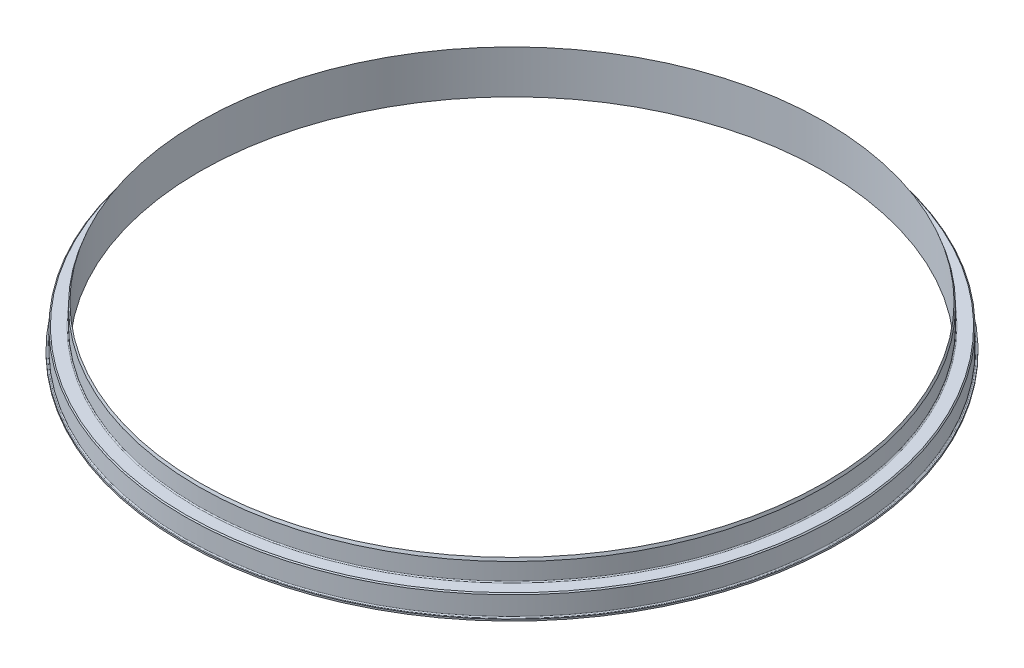
ISO-10303-21;
HEADER;
FILE_DESCRIPTION(('STEP AP214'),'2;1');
FILE_NAME('part.step','',(''),(''),'','','');
FILE_SCHEMA(('AUTOMOTIVE_DESIGN { 1 0 10303 214 1 1 1 1 }'));
ENDSEC;
DATA;
#1=APPLICATION_CONTEXT('core data for automotive mechanical design processes');
#2=APPLICATION_PROTOCOL_DEFINITION('international standard','automotive_design',2000,#1);
#3=PRODUCT_CONTEXT('',#1,'mechanical');
#4=PRODUCT('Part','Part','',(#3));
#5=PRODUCT_RELATED_PRODUCT_CATEGORY('part','',(#4));
#6=PRODUCT_DEFINITION_FORMATION('','',#4);
#7=PRODUCT_DEFINITION_CONTEXT('part definition',#1,'design');
#8=PRODUCT_DEFINITION('design','',#6,#7);
#9=PRODUCT_DEFINITION_SHAPE('','',#8);
#10=(LENGTH_UNIT() NAMED_UNIT(*) SI_UNIT(.MILLI.,.METRE.));
#11=(NAMED_UNIT(*) PLANE_ANGLE_UNIT() SI_UNIT($,.RADIAN.));
#12=(NAMED_UNIT(*) SI_UNIT($,.STERADIAN.) SOLID_ANGLE_UNIT());
#13=UNCERTAINTY_MEASURE_WITH_UNIT(LENGTH_MEASURE(1.E-05),#10,'distance_accuracy_value','');
#14=(GEOMETRIC_REPRESENTATION_CONTEXT(3) GLOBAL_UNCERTAINTY_ASSIGNED_CONTEXT((#13)) GLOBAL_UNIT_ASSIGNED_CONTEXT((#10,
#11,#12)) REPRESENTATION_CONTEXT('',''));
#15=CARTESIAN_POINT('',(0.,0.,0.));
#16=DIRECTION('',(0.,0.,1.));
#17=DIRECTION('',(1.,0.,0.));
#18=AXIS2_PLACEMENT_3D('',#15,#16,#17);
#19=CARTESIAN_POINT('',(0.,19.6862814709172,0.));
#20=DIRECTION('',(0.,-1.,0.));
#21=DIRECTION('',(0.,0.,-1.));
#22=AXIS2_PLACEMENT_3D('',#19,#20,#21);
#23=CONICAL_SURFACE('',#22,152.908,0.349065850398866);
#24=CARTESIAN_POINT('',(0.,21.082,0.));
#25=DIRECTION('',(0.,1.,0.));
#26=DIRECTION('',(0.,0.,1.));
#27=AXIS2_PLACEMENT_3D('',#24,#25,#26);
#28=CIRCLE('',#27,152.4);
#29=CARTESIAN_POINT('',(0.,21.082,152.4));
#30=VERTEX_POINT('',#29);
#31=EDGE_CURVE('E69',#30,#30,#28,.T.);
#32=ORIENTED_EDGE('',*,*,#31,.F.);
#33=EDGE_LOOP('',(#32));
#34=FACE_BOUND('',#33,.T.);
#35=CARTESIAN_POINT('',(0.,19.6862814709172,0.));
#36=DIRECTION('',(0.,1.,0.));
#37=DIRECTION('',(0.,0.,1.));
#38=AXIS2_PLACEMENT_3D('',#35,#36,#37);
#39=CIRCLE('',#38,152.908);
#40=CARTESIAN_POINT('',(0.,19.6862814709172,152.908));
#41=VERTEX_POINT('',#40);
#42=EDGE_CURVE('E57',#41,#41,#39,.T.);
#43=ORIENTED_EDGE('',*,*,#42,.T.);
#44=EDGE_LOOP('',(#43));
#45=FACE_BOUND('',#44,.T.);
#46=ADVANCED_FACE('F31',(#34,#45),#23,.T.);
#47=CARTESIAN_POINT('',(0.,28.7389565787011,0.));
#48=DIRECTION('',(0.,1.,0.));
#49=DIRECTION('',(0.,0.,1.));
#50=AXIS2_PLACEMENT_3D('',#47,#48,#49);
#51=CYLINDRICAL_SURFACE('',#50,152.908);
#52=CARTESIAN_POINT('',(0.,11.43,0.));
#53=DIRECTION('',(0.,-1.,0.));
#54=DIRECTION('',(0.,0.,-1.));
#55=AXIS2_PLACEMENT_3D('',#52,#53,#54);
#56=CIRCLE('',#55,152.908);
#57=CARTESIAN_POINT('',(0.,11.43,-152.908));
#58=VERTEX_POINT('',#57);
#59=EDGE_CURVE('E46',#58,#58,#56,.F.);
#60=ORIENTED_EDGE('',*,*,#59,.T.);
#61=EDGE_LOOP('',(#60));
#62=FACE_BOUND('',#61,.T.);
#63=ORIENTED_EDGE('',*,*,#42,.F.);
#64=EDGE_LOOP('',(#63));
#65=FACE_BOUND('',#64,.T.);
#66=ADVANCED_FACE('F77',(#62,#65),#51,.T.);
#67=CARTESIAN_POINT('',(159.639,10.922,0.));
#68=DIRECTION('',(0.,-1.,0.));
#69=DIRECTION('',(0.,0.,-1.));
#70=AXIS2_PLACEMENT_3D('',#67,#68,#69);
#71=PLANE('',#70);
#72=CARTESIAN_POINT('',(0.,10.922,0.));
#73=DIRECTION('',(0.,-1.,0.));
#74=DIRECTION('',(0.,0.,-1.));
#75=AXIS2_PLACEMENT_3D('',#72,#73,#74);
#76=CIRCLE('',#75,159.131);
#77=CARTESIAN_POINT('',(0.,10.922,-159.131));
#78=VERTEX_POINT('',#77);
#79=EDGE_CURVE('E38',#78,#78,#76,.F.);
#80=ORIENTED_EDGE('',*,*,#79,.T.);
#81=EDGE_LOOP('',(#80));
#82=FACE_BOUND('',#81,.T.);
#83=CARTESIAN_POINT('',(0.,10.922,0.));
#84=DIRECTION('',(0.,-1.,0.));
#85=DIRECTION('',(0.,0.,-1.));
#86=AXIS2_PLACEMENT_3D('',#83,#84,#85);
#87=CIRCLE('',#86,153.416);
#88=CARTESIAN_POINT('',(0.,10.922,-153.416));
#89=VERTEX_POINT('',#88);
#90=EDGE_CURVE('E42',#89,#89,#87,.T.);
#91=ORIENTED_EDGE('',*,*,#90,.T.);
#92=EDGE_LOOP('',(#91));
#93=FACE_BOUND('',#92,.T.);
#94=ADVANCED_FACE('F82',(#82,#93),#71,.F.);
#95=CARTESIAN_POINT('',(0.,28.7389565787011,0.));
#96=DIRECTION('',(0.,1.,0.));
#97=DIRECTION('',(0.,0.,1.));
#98=AXIS2_PLACEMENT_3D('',#95,#96,#97);
#99=CYLINDRICAL_SURFACE('',#98,159.639);
#100=CARTESIAN_POINT('',(0.,10.414,0.));
#101=DIRECTION('',(0.,-1.,0.));
#102=DIRECTION('',(0.,0.,-1.));
#103=AXIS2_PLACEMENT_3D('',#100,#101,#102);
#104=CIRCLE('',#103,159.639);
#105=CARTESIAN_POINT('',(0.,10.414,-159.639));
#106=VERTEX_POINT('',#105);
#107=EDGE_CURVE('E10',#106,#106,#104,.T.);
#108=ORIENTED_EDGE('',*,*,#107,.T.);
#109=EDGE_LOOP('',(#108));
#110=FACE_BOUND('',#109,.T.);
#111=CARTESIAN_POINT('',(0.,1.27000000000001,0.));
#112=DIRECTION('',(0.,-1.,0.));
#113=DIRECTION('',(0.,0.,-1.));
#114=AXIS2_PLACEMENT_3D('',#111,#112,#113);
#115=CIRCLE('',#114,159.639);
#116=CARTESIAN_POINT('',(0.,1.27000000000001,-159.639));
#117=VERTEX_POINT('',#116);
#118=EDGE_CURVE('E54',#117,#117,#115,.F.);
#119=ORIENTED_EDGE('',*,*,#118,.T.);
#120=EDGE_LOOP('',(#119));
#121=FACE_BOUND('',#120,.T.);
#122=ADVANCED_FACE('F88',(#110,#121),#99,.T.);
#123=CARTESIAN_POINT('',(159.639,0.762000000000011,0.));
#124=DIRECTION('',(0.,-1.,0.));
#125=DIRECTION('',(0.,0.,-1.));
#126=AXIS2_PLACEMENT_3D('',#123,#124,#125);
#127=PLANE('',#126);
#128=CARTESIAN_POINT('',(0.,0.762000000000011,0.));
#129=DIRECTION('',(0.,-1.,0.));
#130=DIRECTION('',(0.,0.,-1.));
#131=AXIS2_PLACEMENT_3D('',#128,#129,#130);
#132=CIRCLE('',#131,160.147);
#133=CARTESIAN_POINT('',(0.,0.762000000000011,-160.147));
#134=VERTEX_POINT('',#133);
#135=EDGE_CURVE('E51',#134,#134,#132,.T.);
#136=ORIENTED_EDGE('',*,*,#135,.T.);
#137=EDGE_LOOP('',(#136));
#138=FACE_BOUND('',#137,.T.);
#139=CARTESIAN_POINT('',(0.,0.762000000000002,0.));
#140=DIRECTION('',(0.,1.,0.));
#141=DIRECTION('',(0.,0.,1.));
#142=AXIS2_PLACEMENT_3D('',#139,#140,#141);
#143=CIRCLE('',#142,160.655);
#144=CARTESIAN_POINT('',(0.,0.762000000000002,160.655));
#145=VERTEX_POINT('',#144);
#146=EDGE_CURVE('E60',#145,#145,#143,.T.);
#147=ORIENTED_EDGE('',*,*,#146,.T.);
#148=EDGE_LOOP('',(#147));
#149=FACE_BOUND('',#148,.T.);
#150=ADVANCED_FACE('F119',(#138,#149),#127,.F.);
#151=CARTESIAN_POINT('',(0.,28.7389565787011,0.));
#152=DIRECTION('',(0.,1.,0.));
#153=DIRECTION('',(0.,0.,1.));
#154=AXIS2_PLACEMENT_3D('',#151,#152,#153);
#155=CYLINDRICAL_SURFACE('',#154,160.655);
#156=ORIENTED_EDGE('',*,*,#146,.F.);
#157=EDGE_LOOP('',(#156));
#158=FACE_BOUND('',#157,.T.);
#159=CARTESIAN_POINT('',(0.,0.,0.));
#160=DIRECTION('',(0.,1.,0.));
#161=DIRECTION('',(0.,0.,1.));
#162=AXIS2_PLACEMENT_3D('',#159,#160,#161);
#163=CIRCLE('',#162,160.655);
#164=CARTESIAN_POINT('',(0.,0.,160.655));
#165=VERTEX_POINT('',#164);
#166=EDGE_CURVE('E63',#165,#165,#163,.T.);
#167=ORIENTED_EDGE('',*,*,#166,.T.);
#168=EDGE_LOOP('',(#167));
#169=FACE_BOUND('',#168,.T.);
#170=ADVANCED_FACE('F144',(#158,#169),#155,.T.);
#171=CARTESIAN_POINT('',(152.4,0.,0.));
#172=DIRECTION('',(0.,1.,0.));
#173=DIRECTION('',(0.,0.,1.));
#174=AXIS2_PLACEMENT_3D('',#171,#172,#173);
#175=PLANE('',#174);
#176=ORIENTED_EDGE('',*,*,#166,.F.);
#177=EDGE_LOOP('',(#176));
#178=FACE_BOUND('',#177,.T.);
#179=CARTESIAN_POINT('',(0.,0.,0.));
#180=DIRECTION('',(0.,1.,0.));
#181=DIRECTION('',(0.,0.,1.));
#182=AXIS2_PLACEMENT_3D('',#179,#180,#181);
#183=CIRCLE('',#182,152.4);
#184=CARTESIAN_POINT('',(0.,0.,152.4));
#185=VERTEX_POINT('',#184);
#186=EDGE_CURVE('E66',#185,#185,#183,.T.);
#187=ORIENTED_EDGE('',*,*,#186,.T.);
#188=EDGE_LOOP('',(#187));
#189=FACE_BOUND('',#188,.T.);
#190=ADVANCED_FACE('F159',(#178,#189),#175,.F.);
#191=CARTESIAN_POINT('',(0.,28.7389565787011,0.));
#192=DIRECTION('',(0.,1.,0.));
#193=DIRECTION('',(0.,0.,1.));
#194=AXIS2_PLACEMENT_3D('',#191,#192,#193);
#195=CYLINDRICAL_SURFACE('',#194,152.4);
#196=ORIENTED_EDGE('',*,*,#186,.F.);
#197=EDGE_LOOP('',(#196));
#198=FACE_BOUND('',#197,.T.);
#199=ORIENTED_EDGE('',*,*,#31,.T.);
#200=EDGE_LOOP('',(#199));
#201=FACE_BOUND('',#200,.T.);
#202=ADVANCED_FACE('F73',(#198,#201),#195,.F.);
#203=CARTESIAN_POINT('',(0.,1.27000000000001,0.));
#204=DIRECTION('',(0.,-1.,0.));
#205=DIRECTION('',(0.,0.,-1.));
#206=AXIS2_PLACEMENT_3D('',#203,#204,#205);
#207=TOROIDAL_SURFACE('',#206,160.147,0.508);
#208=ORIENTED_EDGE('',*,*,#135,.F.);
#209=EDGE_LOOP('',(#208));
#210=FACE_BOUND('',#209,.T.);
#211=ORIENTED_EDGE('',*,*,#118,.F.);
#212=EDGE_LOOP('',(#211));
#213=FACE_BOUND('',#212,.T.);
#214=ADVANCED_FACE('F92',(#210,#213),#207,.F.);
#215=CARTESIAN_POINT('',(0.,11.43,0.));
#216=DIRECTION('',(0.,-1.,0.));
#217=DIRECTION('',(0.,0.,-1.));
#218=AXIS2_PLACEMENT_3D('',#215,#216,#217);
#219=TOROIDAL_SURFACE('',#218,153.416,0.508);
#220=ORIENTED_EDGE('',*,*,#90,.F.);
#221=EDGE_LOOP('',(#220));
#222=FACE_BOUND('',#221,.T.);
#223=ORIENTED_EDGE('',*,*,#59,.F.);
#224=EDGE_LOOP('',(#223));
#225=FACE_BOUND('',#224,.T.);
#226=ADVANCED_FACE('F94',(#222,#225),#219,.F.);
#227=CARTESIAN_POINT('',(0.,10.922,0.));
#228=DIRECTION('',(0.,-1.,0.));
#229=DIRECTION('',(0.,0.,-1.));
#230=AXIS2_PLACEMENT_3D('',#227,#228,#229);
#231=CONICAL_SURFACE('',#230,159.131,0.785398163397448);
#232=ORIENTED_EDGE('',*,*,#107,.F.);
#233=EDGE_LOOP('',(#232));
#234=FACE_BOUND('',#233,.T.);
#235=ORIENTED_EDGE('',*,*,#79,.F.);
#236=EDGE_LOOP('',(#235));
#237=FACE_BOUND('',#236,.T.);
#238=ADVANCED_FACE('F33',(#234,#237),#231,.T.);
#239=CLOSED_SHELL('',(#46,#66,#94,#122,#150,#170,#190,#202,#214,#226,#238));
#240=MANIFOLD_SOLID_BREP('B2',#239);
#241=ADVANCED_BREP_SHAPE_REPRESENTATION('',(#18,#240),#14);
#242=SHAPE_DEFINITION_REPRESENTATION(#9,#241);
ENDSEC;
END-ISO-10303-21;
